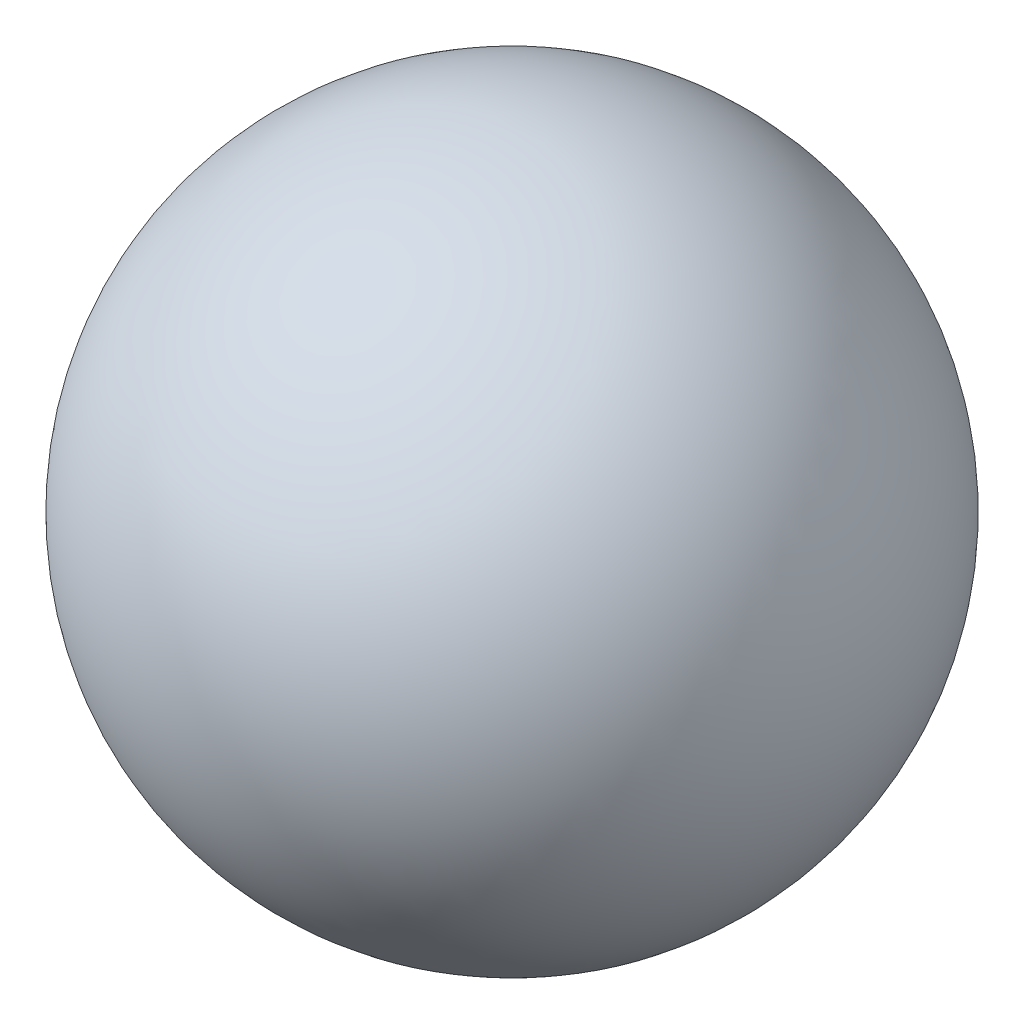
ISO-10303-21;
HEADER;
FILE_DESCRIPTION(('STEP AP214'),'2;1');
FILE_NAME('part.step','',(''),(''),'','','');
FILE_SCHEMA(('AUTOMOTIVE_DESIGN { 1 0 10303 214 1 1 1 1 }'));
ENDSEC;
DATA;
#1=APPLICATION_CONTEXT('core data for automotive mechanical design processes');
#2=APPLICATION_PROTOCOL_DEFINITION('international standard','automotive_design',2000,#1);
#3=PRODUCT_CONTEXT('',#1,'mechanical');
#4=PRODUCT('Part','Part','',(#3));
#5=PRODUCT_RELATED_PRODUCT_CATEGORY('part','',(#4));
#6=PRODUCT_DEFINITION_FORMATION('','',#4);
#7=PRODUCT_DEFINITION_CONTEXT('part definition',#1,'design');
#8=PRODUCT_DEFINITION('design','',#6,#7);
#9=PRODUCT_DEFINITION_SHAPE('','',#8);
#10=(LENGTH_UNIT() NAMED_UNIT(*) SI_UNIT(.MILLI.,.METRE.));
#11=(NAMED_UNIT(*) PLANE_ANGLE_UNIT() SI_UNIT($,.RADIAN.));
#12=(NAMED_UNIT(*) SI_UNIT($,.STERADIAN.) SOLID_ANGLE_UNIT());
#13=UNCERTAINTY_MEASURE_WITH_UNIT(LENGTH_MEASURE(1.E-05),#10,'distance_accuracy_value','');
#14=(GEOMETRIC_REPRESENTATION_CONTEXT(3) GLOBAL_UNCERTAINTY_ASSIGNED_CONTEXT((#13)) GLOBAL_UNIT_ASSIGNED_CONTEXT((#10,
#11,#12)) REPRESENTATION_CONTEXT('',''));
#15=CARTESIAN_POINT('',(0.,0.,0.));
#16=DIRECTION('',(0.,0.,1.));
#17=DIRECTION('',(1.,0.,0.));
#18=AXIS2_PLACEMENT_3D('',#15,#16,#17);
#19=CARTESIAN_POINT('',(16.5929162746212,-0.420988128497947,0.));
#20=DIRECTION('',(0.,1.,0.));
#21=DIRECTION('',(1.,0.,0.));
#22=AXIS2_PLACEMENT_3D('',#19,#20,#21);
#23=SPHERICAL_SURFACE('',#22,30.);
#24=CARTESIAN_POINT('',(16.5929162746212,29.5790118715021,0.));
#25=VERTEX_POINT('',#24);
#26=VERTEX_LOOP('',#25);
#27=FACE_BOUND('',#26,.T.);
#28=ADVANCED_FACE('F29',(#27),#23,.T.);
#29=CLOSED_SHELL('',(#28));
#30=MANIFOLD_SOLID_BREP('B2',#29);
#31=ADVANCED_BREP_SHAPE_REPRESENTATION('',(#18,#30),#14);
#32=SHAPE_DEFINITION_REPRESENTATION(#9,#31);
ENDSEC;
END-ISO-10303-21;
